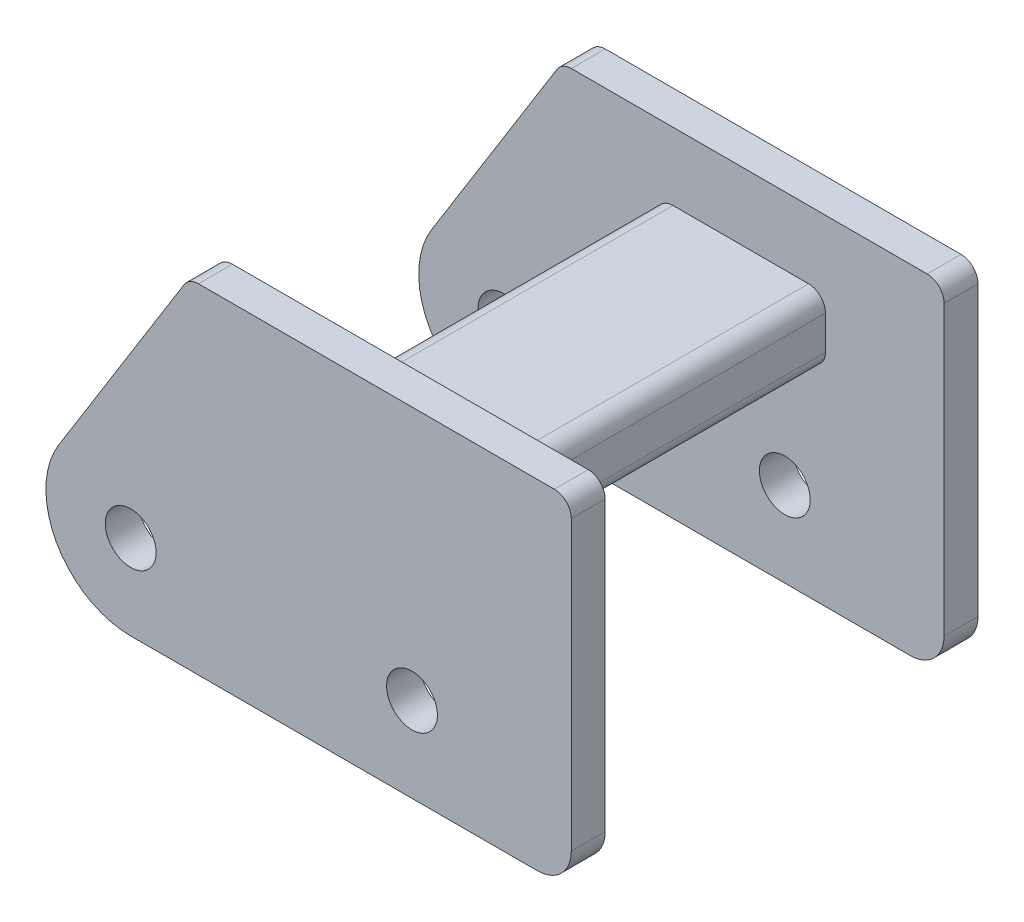
ISO-10303-21;
HEADER;
FILE_DESCRIPTION(('STEP AP214'),'2;1');
FILE_NAME('part.step','',(''),(''),'','','');
FILE_SCHEMA(('AUTOMOTIVE_DESIGN { 1 0 10303 214 1 1 1 1 }'));
ENDSEC;
DATA;
#1=APPLICATION_CONTEXT('core data for automotive mechanical design processes');
#2=APPLICATION_PROTOCOL_DEFINITION('international standard','automotive_design',2000,#1);
#3=PRODUCT_CONTEXT('',#1,'mechanical');
#4=PRODUCT('Part','Part','',(#3));
#5=PRODUCT_RELATED_PRODUCT_CATEGORY('part','',(#4));
#6=PRODUCT_DEFINITION_FORMATION('','',#4);
#7=PRODUCT_DEFINITION_CONTEXT('part definition',#1,'design');
#8=PRODUCT_DEFINITION('design','',#6,#7);
#9=PRODUCT_DEFINITION_SHAPE('','',#8);
#10=(LENGTH_UNIT() NAMED_UNIT(*) SI_UNIT(.MILLI.,.METRE.));
#11=(NAMED_UNIT(*) PLANE_ANGLE_UNIT() SI_UNIT($,.RADIAN.));
#12=(NAMED_UNIT(*) SI_UNIT($,.STERADIAN.) SOLID_ANGLE_UNIT());
#13=UNCERTAINTY_MEASURE_WITH_UNIT(LENGTH_MEASURE(1.E-05),#10,'distance_accuracy_value','');
#14=(GEOMETRIC_REPRESENTATION_CONTEXT(3) GLOBAL_UNCERTAINTY_ASSIGNED_CONTEXT((#13)) GLOBAL_UNIT_ASSIGNED_CONTEXT((#10,
#11,#12)) REPRESENTATION_CONTEXT('',''));
#15=CARTESIAN_POINT('',(0.,0.,0.));
#16=DIRECTION('',(0.,0.,1.));
#17=DIRECTION('',(1.,0.,0.));
#18=AXIS2_PLACEMENT_3D('',#15,#16,#17);
#19=CARTESIAN_POINT('',(12.5,7.,1.));
#20=DIRECTION('',(0.,0.,-1.));
#21=DIRECTION('',(-1.,0.,0.));
#22=AXIS2_PLACEMENT_3D('',#19,#20,#21);
#23=CYLINDRICAL_SURFACE('',#22,0.5);
#24=CARTESIAN_POINT('',(12.5,7.,0.));
#25=DIRECTION('',(0.,0.,1.));
#26=DIRECTION('',(1.,0.,0.));
#27=AXIS2_PLACEMENT_3D('',#24,#25,#26);
#28=CIRCLE('',#27,0.5);
#29=CARTESIAN_POINT('',(13.,7.,0.));
#30=VERTEX_POINT('',#29);
#31=CARTESIAN_POINT('',(12.5,7.5,0.));
#32=VERTEX_POINT('',#31);
#33=EDGE_CURVE('E258',#30,#32,#28,.T.);
#34=ORIENTED_EDGE('',*,*,#33,.T.);
#35=DIRECTION('',(0.,0.,-1.));
#36=VECTOR('',#35,1.);
#37=CARTESIAN_POINT('',(12.5,7.5,1.));
#38=LINE('',#37,#36);
#39=CARTESIAN_POINT('',(12.5,7.5,1.));
#40=VERTEX_POINT('',#39);
#41=EDGE_CURVE('E146',#40,#32,#38,.T.);
#42=ORIENTED_EDGE('',*,*,#41,.F.);
#43=CARTESIAN_POINT('',(12.5,7.,1.));
#44=DIRECTION('',(0.,0.,1.));
#45=DIRECTION('',(1.,0.,0.));
#46=AXIS2_PLACEMENT_3D('',#43,#44,#45);
#47=CIRCLE('',#46,0.5);
#48=CARTESIAN_POINT('',(13.,7.,1.));
#49=VERTEX_POINT('',#48);
#50=EDGE_CURVE('E203',#49,#40,#47,.T.);
#51=ORIENTED_EDGE('',*,*,#50,.F.);
#52=DIRECTION('',(0.,0.,-1.));
#53=VECTOR('',#52,1.);
#54=CARTESIAN_POINT('',(13.,7.,1.));
#55=LINE('',#54,#53);
#56=EDGE_CURVE('E12',#49,#30,#55,.T.);
#57=ORIENTED_EDGE('',*,*,#56,.T.);
#58=EDGE_LOOP('',(#34,#42,#51,#57));
#59=FACE_BOUND('',#58,.T.);
#60=ADVANCED_FACE('F138',(#59),#23,.T.);
#61=CARTESIAN_POINT('',(0.,7.5,1.));
#62=DIRECTION('',(0.,-1.,0.));
#63=DIRECTION('',(0.,0.,-1.));
#64=AXIS2_PLACEMENT_3D('',#61,#62,#63);
#65=PLANE('',#64);
#66=DIRECTION('',(-1.,0.,0.));
#67=VECTOR('',#66,1.);
#68=CARTESIAN_POINT('',(0.,7.5,0.));
#69=LINE('',#68,#67);
#70=CARTESIAN_POINT('',(2.,7.5,0.));
#71=VERTEX_POINT('',#70);
#72=EDGE_CURVE('E260',#32,#71,#69,.T.);
#73=ORIENTED_EDGE('',*,*,#72,.T.);
#74=DIRECTION('',(0.,0.,-1.));
#75=VECTOR('',#74,1.);
#76=CARTESIAN_POINT('',(2.,7.5,1.));
#77=LINE('',#76,#75);
#78=CARTESIAN_POINT('',(2.,7.5,1.));
#79=VERTEX_POINT('',#78);
#80=EDGE_CURVE('E278',#79,#71,#77,.T.);
#81=ORIENTED_EDGE('',*,*,#80,.F.);
#82=DIRECTION('',(-1.,0.,0.));
#83=VECTOR('',#82,1.);
#84=CARTESIAN_POINT('',(0.,7.5,1.));
#85=LINE('',#84,#83);
#86=EDGE_CURVE('E285',#40,#79,#85,.T.);
#87=ORIENTED_EDGE('',*,*,#86,.F.);
#88=ORIENTED_EDGE('',*,*,#41,.T.);
#89=EDGE_LOOP('',(#73,#81,#87,#88));
#90=FACE_BOUND('',#89,.T.);
#91=ADVANCED_FACE('F283',(#90),#65,.F.);
#92=CARTESIAN_POINT('',(2.,7.,1.));
#93=DIRECTION('',(0.,0.,-1.));
#94=DIRECTION('',(-1.,0.,0.));
#95=AXIS2_PLACEMENT_3D('',#92,#93,#94);
#96=CYLINDRICAL_SURFACE('',#95,0.500000000000001);
#97=CARTESIAN_POINT('',(2.,7.,0.));
#98=DIRECTION('',(0.,0.,1.));
#99=DIRECTION('',(1.,0.,0.));
#100=AXIS2_PLACEMENT_3D('',#97,#98,#99);
#101=CIRCLE('',#100,0.500000000000001);
#102=CARTESIAN_POINT('',(1.57547169811321,7.26415094339623,0.));
#103=VERTEX_POINT('',#102);
#104=EDGE_CURVE('E263',#103,#71,#101,.F.);
#105=ORIENTED_EDGE('',*,*,#104,.F.);
#106=DIRECTION('',(0.,0.,-1.));
#107=VECTOR('',#106,1.);
#108=CARTESIAN_POINT('',(1.57547169811321,7.26415094339623,1.));
#109=LINE('',#108,#107);
#110=CARTESIAN_POINT('',(1.57547169811321,7.26415094339623,1.));
#111=VERTEX_POINT('',#110);
#112=EDGE_CURVE('E276',#111,#103,#109,.T.);
#113=ORIENTED_EDGE('',*,*,#112,.F.);
#114=CARTESIAN_POINT('',(2.,7.,1.));
#115=DIRECTION('',(0.,0.,1.));
#116=DIRECTION('',(1.,0.,0.));
#117=AXIS2_PLACEMENT_3D('',#114,#115,#116);
#118=CIRCLE('',#117,0.500000000000001);
#119=EDGE_CURVE('E294',#111,#79,#118,.F.);
#120=ORIENTED_EDGE('',*,*,#119,.T.);
#121=ORIENTED_EDGE('',*,*,#80,.T.);
#122=EDGE_LOOP('',(#105,#113,#120,#121));
#123=FACE_BOUND('',#122,.T.);
#124=ADVANCED_FACE('F292',(#123),#96,.T.);
#125=CARTESIAN_POINT('',(-2.12264150943396,1.32075471698113,1.));
#126=DIRECTION('',(0.849056603773585,-0.528301886792453,0.));
#127=DIRECTION('',(0.528301886792453,0.849056603773584,0.));
#128=AXIS2_PLACEMENT_3D('',#125,#126,#127);
#129=PLANE('',#128);
#130=DIRECTION('',(-0.528301886792453,-0.849056603773585,0.));
#131=VECTOR('',#130,1.);
#132=CARTESIAN_POINT('',(-2.12264150943396,1.32075471698113,0.));
#133=LINE('',#132,#131);
#134=CARTESIAN_POINT('',(-2.12264150943396,1.32075471698113,0.));
#135=VERTEX_POINT('',#134);
#136=EDGE_CURVE('E266',#103,#135,#133,.T.);
#137=ORIENTED_EDGE('',*,*,#136,.T.);
#138=DIRECTION('',(0.,0.,-1.));
#139=VECTOR('',#138,1.);
#140=CARTESIAN_POINT('',(-2.12264150943396,1.32075471698113,1.));
#141=LINE('',#140,#139);
#142=CARTESIAN_POINT('',(-2.12264150943396,1.32075471698113,1.));
#143=VERTEX_POINT('',#142);
#144=EDGE_CURVE('E239',#143,#135,#141,.T.);
#145=ORIENTED_EDGE('',*,*,#144,.F.);
#146=DIRECTION('',(-0.528301886792453,-0.849056603773585,0.));
#147=VECTOR('',#146,1.);
#148=CARTESIAN_POINT('',(-2.12264150943396,1.32075471698113,1.));
#149=LINE('',#148,#147);
#150=EDGE_CURVE('E227',#111,#143,#149,.T.);
#151=ORIENTED_EDGE('',*,*,#150,.F.);
#152=ORIENTED_EDGE('',*,*,#112,.T.);
#153=EDGE_LOOP('',(#137,#145,#151,#152));
#154=FACE_BOUND('',#153,.T.);
#155=ADVANCED_FACE('F519',(#154),#129,.F.);
#156=CARTESIAN_POINT('',(0.,0.,1.));
#157=DIRECTION('',(0.,0.,-1.));
#158=DIRECTION('',(-1.,0.,0.));
#159=AXIS2_PLACEMENT_3D('',#156,#157,#158);
#160=CYLINDRICAL_SURFACE('',#159,2.5);
#161=CARTESIAN_POINT('',(0.,0.,0.));
#162=DIRECTION('',(0.,0.,1.));
#163=DIRECTION('',(1.,0.,0.));
#164=AXIS2_PLACEMENT_3D('',#161,#162,#163);
#165=CIRCLE('',#164,2.5);
#166=CARTESIAN_POINT('',(0.,-2.5,0.));
#167=VERTEX_POINT('',#166);
#168=EDGE_CURVE('E236',#135,#167,#165,.T.);
#169=ORIENTED_EDGE('',*,*,#168,.T.);
#170=DIRECTION('',(0.,0.,-1.));
#171=VECTOR('',#170,1.);
#172=CARTESIAN_POINT('',(0.,-2.5,1.));
#173=LINE('',#172,#171);
#174=CARTESIAN_POINT('',(0.,-2.5,1.));
#175=VERTEX_POINT('',#174);
#176=EDGE_CURVE('E233',#175,#167,#173,.T.);
#177=ORIENTED_EDGE('',*,*,#176,.F.);
#178=CARTESIAN_POINT('',(0.,0.,1.));
#179=DIRECTION('',(0.,0.,1.));
#180=DIRECTION('',(1.,0.,0.));
#181=AXIS2_PLACEMENT_3D('',#178,#179,#180);
#182=CIRCLE('',#181,2.5);
#183=EDGE_CURVE('E219',#143,#175,#182,.T.);
#184=ORIENTED_EDGE('',*,*,#183,.F.);
#185=ORIENTED_EDGE('',*,*,#144,.T.);
#186=EDGE_LOOP('',(#169,#177,#184,#185));
#187=FACE_BOUND('',#186,.T.);
#188=ADVANCED_FACE('F234',(#187),#160,.T.);
#189=CARTESIAN_POINT('',(0.,-2.5,1.));
#190=DIRECTION('',(0.,1.,0.));
#191=DIRECTION('',(0.,0.,1.));
#192=AXIS2_PLACEMENT_3D('',#189,#190,#191);
#193=PLANE('',#192);
#194=DIRECTION('',(1.,0.,0.));
#195=VECTOR('',#194,1.);
#196=CARTESIAN_POINT('',(0.,-2.5,0.));
#197=LINE('',#196,#195);
#198=CARTESIAN_POINT('',(12.,-2.5,0.));
#199=VERTEX_POINT('',#198);
#200=EDGE_CURVE('E269',#167,#199,#197,.T.);
#201=ORIENTED_EDGE('',*,*,#200,.T.);
#202=DIRECTION('',(0.,0.,-1.));
#203=VECTOR('',#202,1.);
#204=CARTESIAN_POINT('',(12.,-2.5,1.));
#205=LINE('',#204,#203);
#206=CARTESIAN_POINT('',(12.,-2.5,1.));
#207=VERTEX_POINT('',#206);
#208=EDGE_CURVE('E240',#207,#199,#205,.T.);
#209=ORIENTED_EDGE('',*,*,#208,.F.);
#210=DIRECTION('',(1.,0.,0.));
#211=VECTOR('',#210,1.);
#212=CARTESIAN_POINT('',(0.,-2.5,1.));
#213=LINE('',#212,#211);
#214=EDGE_CURVE('E223',#175,#207,#213,.T.);
#215=ORIENTED_EDGE('',*,*,#214,.F.);
#216=ORIENTED_EDGE('',*,*,#176,.T.);
#217=EDGE_LOOP('',(#201,#209,#215,#216));
#218=FACE_BOUND('',#217,.T.);
#219=ADVANCED_FACE('F242',(#218),#193,.F.);
#220=CARTESIAN_POINT('',(12.,-1.5,1.));
#221=DIRECTION('',(0.,0.,-1.));
#222=DIRECTION('',(-1.,0.,0.));
#223=AXIS2_PLACEMENT_3D('',#220,#221,#222);
#224=CYLINDRICAL_SURFACE('',#223,1.);
#225=CARTESIAN_POINT('',(12.,-1.5,0.));
#226=DIRECTION('',(0.,0.,1.));
#227=DIRECTION('',(1.,0.,0.));
#228=AXIS2_PLACEMENT_3D('',#225,#226,#227);
#229=CIRCLE('',#228,1.);
#230=CARTESIAN_POINT('',(13.,-1.5,0.));
#231=VERTEX_POINT('',#230);
#232=EDGE_CURVE('E195',#199,#231,#229,.T.);
#233=ORIENTED_EDGE('',*,*,#232,.T.);
#234=DIRECTION('',(0.,0.,-1.));
#235=VECTOR('',#234,1.);
#236=CARTESIAN_POINT('',(13.,-1.5,1.));
#237=LINE('',#236,#235);
#238=CARTESIAN_POINT('',(13.,-1.5,1.));
#239=VERTEX_POINT('',#238);
#240=EDGE_CURVE('E244',#239,#231,#237,.T.);
#241=ORIENTED_EDGE('',*,*,#240,.F.);
#242=CARTESIAN_POINT('',(12.,-1.5,1.));
#243=DIRECTION('',(0.,0.,1.));
#244=DIRECTION('',(1.,0.,0.));
#245=AXIS2_PLACEMENT_3D('',#242,#243,#244);
#246=CIRCLE('',#245,1.);
#247=EDGE_CURVE('E162',#207,#239,#246,.T.);
#248=ORIENTED_EDGE('',*,*,#247,.F.);
#249=ORIENTED_EDGE('',*,*,#208,.T.);
#250=EDGE_LOOP('',(#233,#241,#248,#249));
#251=FACE_BOUND('',#250,.T.);
#252=ADVANCED_FACE('F490',(#251),#224,.T.);
#253=CARTESIAN_POINT('',(13.,0.,1.));
#254=DIRECTION('',(-1.,0.,0.));
#255=DIRECTION('',(0.,-1.,0.));
#256=AXIS2_PLACEMENT_3D('',#253,#254,#255);
#257=PLANE('',#256);
#258=DIRECTION('',(0.,1.,0.));
#259=VECTOR('',#258,1.);
#260=CARTESIAN_POINT('',(13.,0.,0.));
#261=LINE('',#260,#259);
#262=EDGE_CURVE('E255',#231,#30,#261,.T.);
#263=ORIENTED_EDGE('',*,*,#262,.T.);
#264=ORIENTED_EDGE('',*,*,#56,.F.);
#265=DIRECTION('',(0.,1.,0.));
#266=VECTOR('',#265,1.);
#267=CARTESIAN_POINT('',(13.,0.,1.));
#268=LINE('',#267,#266);
#269=EDGE_CURVE('E299',#239,#49,#268,.T.);
#270=ORIENTED_EDGE('',*,*,#269,.F.);
#271=ORIENTED_EDGE('',*,*,#240,.T.);
#272=EDGE_LOOP('',(#263,#264,#270,#271));
#273=FACE_BOUND('',#272,.T.);
#274=ADVANCED_FACE('F487',(#273),#257,.F.);
#275=CARTESIAN_POINT('',(0.,0.,1.));
#276=DIRECTION('',(0.,0.,-1.));
#277=DIRECTION('',(-1.,0.,0.));
#278=AXIS2_PLACEMENT_3D('',#275,#276,#277);
#279=CYLINDRICAL_SURFACE('',#278,0.75);
#280=CARTESIAN_POINT('',(0.,0.,1.));
#281=DIRECTION('',(0.,0.,1.));
#282=DIRECTION('',(1.,0.,0.));
#283=AXIS2_PLACEMENT_3D('',#280,#281,#282);
#284=CIRCLE('',#283,0.75);
#285=CARTESIAN_POINT('',(0.75,0.,1.));
#286=VERTEX_POINT('',#285);
#287=EDGE_CURVE('E301',#286,#286,#284,.T.);
#288=ORIENTED_EDGE('',*,*,#287,.T.);
#289=EDGE_LOOP('',(#288));
#290=FACE_BOUND('',#289,.T.);
#291=CARTESIAN_POINT('',(0.,0.,0.));
#292=DIRECTION('',(0.,0.,1.));
#293=DIRECTION('',(1.,0.,0.));
#294=AXIS2_PLACEMENT_3D('',#291,#292,#293);
#295=CIRCLE('',#294,0.75);
#296=CARTESIAN_POINT('',(0.75,0.,0.));
#297=VERTEX_POINT('',#296);
#298=EDGE_CURVE('E251',#297,#297,#295,.T.);
#299=ORIENTED_EDGE('',*,*,#298,.F.);
#300=EDGE_LOOP('',(#299));
#301=FACE_BOUND('',#300,.T.);
#302=ADVANCED_FACE('F489',(#290,#301),#279,.F.);
#303=CARTESIAN_POINT('',(8.3,0.,1.));
#304=DIRECTION('',(0.,0.,-1.));
#305=DIRECTION('',(-1.,0.,0.));
#306=AXIS2_PLACEMENT_3D('',#303,#304,#305);
#307=CYLINDRICAL_SURFACE('',#306,0.75);
#308=CARTESIAN_POINT('',(8.3,0.,1.));
#309=DIRECTION('',(0.,0.,1.));
#310=DIRECTION('',(1.,0.,0.));
#311=AXIS2_PLACEMENT_3D('',#308,#309,#310);
#312=CIRCLE('',#311,0.75);
#313=CARTESIAN_POINT('',(9.05,0.,1.));
#314=VERTEX_POINT('',#313);
#315=EDGE_CURVE('E272',#314,#314,#312,.T.);
#316=ORIENTED_EDGE('',*,*,#315,.T.);
#317=EDGE_LOOP('',(#316));
#318=FACE_BOUND('',#317,.T.);
#319=CARTESIAN_POINT('',(8.3,0.,0.));
#320=DIRECTION('',(0.,0.,1.));
#321=DIRECTION('',(1.,0.,0.));
#322=AXIS2_PLACEMENT_3D('',#319,#320,#321);
#323=CIRCLE('',#322,0.75);
#324=CARTESIAN_POINT('',(9.05,0.,0.));
#325=VERTEX_POINT('',#324);
#326=EDGE_CURVE('E248',#325,#325,#323,.T.);
#327=ORIENTED_EDGE('',*,*,#326,.F.);
#328=EDGE_LOOP('',(#327));
#329=FACE_BOUND('',#328,.T.);
#330=ADVANCED_FACE('F140',(#318,#329),#307,.F.);
#331=CARTESIAN_POINT('',(0.,0.,0.));
#332=DIRECTION('',(0.,0.,1.));
#333=DIRECTION('',(1.,0.,0.));
#334=AXIS2_PLACEMENT_3D('',#331,#332,#333);
#335=PLANE('',#334);
#336=ORIENTED_EDGE('',*,*,#326,.T.);
#337=EDGE_LOOP('',(#336));
#338=FACE_BOUND('',#337,.T.);
#339=ORIENTED_EDGE('',*,*,#298,.T.);
#340=EDGE_LOOP('',(#339));
#341=FACE_BOUND('',#340,.T.);
#342=ORIENTED_EDGE('',*,*,#262,.F.);
#343=ORIENTED_EDGE('',*,*,#232,.F.);
#344=ORIENTED_EDGE('',*,*,#200,.F.);
#345=ORIENTED_EDGE('',*,*,#168,.F.);
#346=ORIENTED_EDGE('',*,*,#136,.F.);
#347=ORIENTED_EDGE('',*,*,#104,.T.);
#348=ORIENTED_EDGE('',*,*,#72,.F.);
#349=ORIENTED_EDGE('',*,*,#33,.F.);
#350=EDGE_LOOP('',(#342,#343,#344,#345,#346,#347,#348,#349));
#351=FACE_BOUND('',#350,.T.);
#352=ADVANCED_FACE('F288',(#338,#341,#351),#335,.F.);
#353=CARTESIAN_POINT('',(0.,0.,1.));
#354=DIRECTION('',(0.,0.,1.));
#355=DIRECTION('',(1.,0.,0.));
#356=AXIS2_PLACEMENT_3D('',#353,#354,#355);
#357=PLANE('',#356);
#358=CARTESIAN_POINT('',(5.,5.,1.));
#359=DIRECTION('',(0.,0.,1.));
#360=DIRECTION('',(1.,0.,0.));
#361=AXIS2_PLACEMENT_3D('',#358,#359,#360);
#362=CIRCLE('',#361,0.5);
#363=CARTESIAN_POINT('',(5.,5.5,1.));
#364=VERTEX_POINT('',#363);
#365=CARTESIAN_POINT('',(4.5,5.,1.));
#366=VERTEX_POINT('',#365);
#367=EDGE_CURVE('E345',#364,#366,#362,.T.);
#368=ORIENTED_EDGE('',*,*,#367,.F.);
#369=DIRECTION('',(-1.,0.,0.));
#370=VECTOR('',#369,1.);
#371=CARTESIAN_POINT('',(0.,5.5,1.));
#372=LINE('',#371,#370);
#373=CARTESIAN_POINT('',(9.,5.5,1.));
#374=VERTEX_POINT('',#373);
#375=EDGE_CURVE('E348',#374,#364,#372,.T.);
#376=ORIENTED_EDGE('',*,*,#375,.F.);
#377=CARTESIAN_POINT('',(9.,5.,1.));
#378=DIRECTION('',(0.,0.,1.));
#379=DIRECTION('',(1.,0.,0.));
#380=AXIS2_PLACEMENT_3D('',#377,#378,#379);
#381=CIRCLE('',#380,0.500000000000001);
#382=CARTESIAN_POINT('',(9.5,5.,1.));
#383=VERTEX_POINT('',#382);
#384=EDGE_CURVE('E328',#383,#374,#381,.T.);
#385=ORIENTED_EDGE('',*,*,#384,.F.);
#386=DIRECTION('',(0.,1.,0.));
#387=VECTOR('',#386,1.);
#388=CARTESIAN_POINT('',(9.49999999999999,0.,1.));
#389=LINE('',#388,#387);
#390=CARTESIAN_POINT('',(9.5,4.,1.));
#391=VERTEX_POINT('',#390);
#392=EDGE_CURVE('E331',#391,#383,#389,.T.);
#393=ORIENTED_EDGE('',*,*,#392,.F.);
#394=CARTESIAN_POINT('',(9.,4.,1.));
#395=DIRECTION('',(0.,0.,1.));
#396=DIRECTION('',(1.,0.,0.));
#397=AXIS2_PLACEMENT_3D('',#394,#395,#396);
#398=CIRCLE('',#397,0.5);
#399=CARTESIAN_POINT('',(9.,3.5,1.));
#400=VERTEX_POINT('',#399);
#401=EDGE_CURVE('E333',#400,#391,#398,.T.);
#402=ORIENTED_EDGE('',*,*,#401,.F.);
#403=DIRECTION('',(-1.,0.,0.));
#404=VECTOR('',#403,1.);
#405=CARTESIAN_POINT('',(0.,3.5,1.));
#406=LINE('',#405,#404);
#407=CARTESIAN_POINT('',(5.,3.5,1.));
#408=VERTEX_POINT('',#407);
#409=EDGE_CURVE('E336',#400,#408,#406,.T.);
#410=ORIENTED_EDGE('',*,*,#409,.T.);
#411=CARTESIAN_POINT('',(5.,4.,1.));
#412=DIRECTION('',(0.,0.,1.));
#413=DIRECTION('',(1.,0.,0.));
#414=AXIS2_PLACEMENT_3D('',#411,#412,#413);
#415=CIRCLE('',#414,0.499999999999999);
#416=CARTESIAN_POINT('',(4.5,4.,1.));
#417=VERTEX_POINT('',#416);
#418=EDGE_CURVE('E339',#417,#408,#415,.T.);
#419=ORIENTED_EDGE('',*,*,#418,.F.);
#420=DIRECTION('',(0.,1.,0.));
#421=VECTOR('',#420,1.);
#422=CARTESIAN_POINT('',(4.50000000000001,0.,1.));
#423=LINE('',#422,#421);
#424=EDGE_CURVE('E342',#417,#366,#423,.T.);
#425=ORIENTED_EDGE('',*,*,#424,.T.);
#426=EDGE_LOOP('',(#368,#376,#385,#393,#402,#410,#419,#425));
#427=FACE_BOUND('',#426,.T.);
#428=ORIENTED_EDGE('',*,*,#315,.F.);
#429=EDGE_LOOP('',(#428));
#430=FACE_BOUND('',#429,.T.);
#431=ORIENTED_EDGE('',*,*,#287,.F.);
#432=EDGE_LOOP('',(#431));
#433=FACE_BOUND('',#432,.T.);
#434=ORIENTED_EDGE('',*,*,#269,.T.);
#435=ORIENTED_EDGE('',*,*,#50,.T.);
#436=ORIENTED_EDGE('',*,*,#86,.T.);
#437=ORIENTED_EDGE('',*,*,#119,.F.);
#438=ORIENTED_EDGE('',*,*,#150,.T.);
#439=ORIENTED_EDGE('',*,*,#183,.T.);
#440=ORIENTED_EDGE('',*,*,#214,.T.);
#441=ORIENTED_EDGE('',*,*,#247,.T.);
#442=EDGE_LOOP('',(#434,#435,#436,#437,#438,#439,#440,#441));
#443=FACE_BOUND('',#442,.T.);
#444=ADVANCED_FACE('F221',(#427,#430,#433,#443),#357,.T.);
#445=CARTESIAN_POINT('',(0.,5.5,11.));
#446=DIRECTION('',(0.,-1.,0.));
#447=DIRECTION('',(0.,0.,-1.));
#448=AXIS2_PLACEMENT_3D('',#445,#446,#447);
#449=PLANE('',#448);
#450=ORIENTED_EDGE('',*,*,#375,.T.);
#451=DIRECTION('',(0.,0.,-1.));
#452=VECTOR('',#451,1.);
#453=CARTESIAN_POINT('',(5.,5.5,11.));
#454=LINE('',#453,#452);
#455=CARTESIAN_POINT('',(5.,5.5,11.));
#456=VERTEX_POINT('',#455);
#457=EDGE_CURVE('E252',#456,#364,#454,.T.);
#458=ORIENTED_EDGE('',*,*,#457,.F.);
#459=DIRECTION('',(-1.,0.,0.));
#460=VECTOR('',#459,1.);
#461=CARTESIAN_POINT('',(0.,5.5,11.));
#462=LINE('',#461,#460);
#463=CARTESIAN_POINT('',(9.,5.5,11.));
#464=VERTEX_POINT('',#463);
#465=EDGE_CURVE('E330',#464,#456,#462,.T.);
#466=ORIENTED_EDGE('',*,*,#465,.F.);
#467=DIRECTION('',(0.,0.,-1.));
#468=VECTOR('',#467,1.);
#469=CARTESIAN_POINT('',(9.,5.5,11.));
#470=LINE('',#469,#468);
#471=EDGE_CURVE('E324',#464,#374,#470,.T.);
#472=ORIENTED_EDGE('',*,*,#471,.T.);
#473=EDGE_LOOP('',(#450,#458,#466,#472));
#474=FACE_BOUND('',#473,.T.);
#475=ADVANCED_FACE('F508',(#474),#449,.F.);
#476=CARTESIAN_POINT('',(5.,5.,11.));
#477=DIRECTION('',(0.,0.,-1.));
#478=DIRECTION('',(-1.,0.,0.));
#479=AXIS2_PLACEMENT_3D('',#476,#477,#478);
#480=CYLINDRICAL_SURFACE('',#479,0.5);
#481=ORIENTED_EDGE('',*,*,#367,.T.);
#482=DIRECTION('',(0.,0.,-1.));
#483=VECTOR('',#482,1.);
#484=CARTESIAN_POINT('',(4.5,5.,11.));
#485=LINE('',#484,#483);
#486=CARTESIAN_POINT('',(4.5,5.,11.));
#487=VERTEX_POINT('',#486);
#488=EDGE_CURVE('E308',#487,#366,#485,.T.);
#489=ORIENTED_EDGE('',*,*,#488,.F.);
#490=CARTESIAN_POINT('',(5.,5.,11.));
#491=DIRECTION('',(0.,0.,1.));
#492=DIRECTION('',(1.,0.,0.));
#493=AXIS2_PLACEMENT_3D('',#490,#491,#492);
#494=CIRCLE('',#493,0.5);
#495=EDGE_CURVE('E369',#456,#487,#494,.T.);
#496=ORIENTED_EDGE('',*,*,#495,.F.);
#497=ORIENTED_EDGE('',*,*,#457,.T.);
#498=EDGE_LOOP('',(#481,#489,#496,#497));
#499=FACE_BOUND('',#498,.T.);
#500=ADVANCED_FACE('F576',(#499),#480,.T.);
#501=CARTESIAN_POINT('',(4.50000000000001,0.,11.));
#502=DIRECTION('',(-1.,0.,0.));
#503=DIRECTION('',(0.,-1.,0.));
#504=AXIS2_PLACEMENT_3D('',#501,#502,#503);
#505=PLANE('',#504);
#506=ORIENTED_EDGE('',*,*,#424,.F.);
#507=DIRECTION('',(0.,0.,-1.));
#508=VECTOR('',#507,1.);
#509=CARTESIAN_POINT('',(4.5,4.,11.));
#510=LINE('',#509,#508);
#511=CARTESIAN_POINT('',(4.5,4.,11.));
#512=VERTEX_POINT('',#511);
#513=EDGE_CURVE('E311',#512,#417,#510,.T.);
#514=ORIENTED_EDGE('',*,*,#513,.F.);
#515=DIRECTION('',(0.,1.,0.));
#516=VECTOR('',#515,1.);
#517=CARTESIAN_POINT('',(4.50000000000001,0.,11.));
#518=LINE('',#517,#516);
#519=EDGE_CURVE('E366',#512,#487,#518,.T.);
#520=ORIENTED_EDGE('',*,*,#519,.T.);
#521=ORIENTED_EDGE('',*,*,#488,.T.);
#522=EDGE_LOOP('',(#506,#514,#520,#521));
#523=FACE_BOUND('',#522,.T.);
#524=ADVANCED_FACE('F585',(#523),#505,.T.);
#525=CARTESIAN_POINT('',(5.,4.,11.));
#526=DIRECTION('',(0.,0.,-1.));
#527=DIRECTION('',(-1.,0.,0.));
#528=AXIS2_PLACEMENT_3D('',#525,#526,#527);
#529=CYLINDRICAL_SURFACE('',#528,0.499999999999999);
#530=ORIENTED_EDGE('',*,*,#418,.T.);
#531=DIRECTION('',(0.,0.,-1.));
#532=VECTOR('',#531,1.);
#533=CARTESIAN_POINT('',(5.,3.5,11.));
#534=LINE('',#533,#532);
#535=CARTESIAN_POINT('',(5.,3.5,11.));
#536=VERTEX_POINT('',#535);
#537=EDGE_CURVE('E314',#536,#408,#534,.T.);
#538=ORIENTED_EDGE('',*,*,#537,.F.);
#539=CARTESIAN_POINT('',(5.,4.,11.));
#540=DIRECTION('',(0.,0.,1.));
#541=DIRECTION('',(1.,0.,0.));
#542=AXIS2_PLACEMENT_3D('',#539,#540,#541);
#543=CIRCLE('',#542,0.499999999999999);
#544=EDGE_CURVE('E363',#512,#536,#543,.T.);
#545=ORIENTED_EDGE('',*,*,#544,.F.);
#546=ORIENTED_EDGE('',*,*,#513,.T.);
#547=EDGE_LOOP('',(#530,#538,#545,#546));
#548=FACE_BOUND('',#547,.T.);
#549=ADVANCED_FACE('F595',(#548),#529,.T.);
#550=CARTESIAN_POINT('',(0.,3.5,11.));
#551=DIRECTION('',(0.,-1.,0.));
#552=DIRECTION('',(0.,0.,-1.));
#553=AXIS2_PLACEMENT_3D('',#550,#551,#552);
#554=PLANE('',#553);
#555=ORIENTED_EDGE('',*,*,#409,.F.);
#556=DIRECTION('',(0.,0.,-1.));
#557=VECTOR('',#556,1.);
#558=CARTESIAN_POINT('',(9.,3.5,11.));
#559=LINE('',#558,#557);
#560=CARTESIAN_POINT('',(9.,3.5,11.));
#561=VERTEX_POINT('',#560);
#562=EDGE_CURVE('E317',#561,#400,#559,.T.);
#563=ORIENTED_EDGE('',*,*,#562,.F.);
#564=DIRECTION('',(-1.,0.,0.));
#565=VECTOR('',#564,1.);
#566=CARTESIAN_POINT('',(0.,3.5,11.));
#567=LINE('',#566,#565);
#568=EDGE_CURVE('E360',#561,#536,#567,.T.);
#569=ORIENTED_EDGE('',*,*,#568,.T.);
#570=ORIENTED_EDGE('',*,*,#537,.T.);
#571=EDGE_LOOP('',(#555,#563,#569,#570));
#572=FACE_BOUND('',#571,.T.);
#573=ADVANCED_FACE('F605',(#572),#554,.T.);
#574=CARTESIAN_POINT('',(9.,4.,11.));
#575=DIRECTION('',(0.,0.,-1.));
#576=DIRECTION('',(-1.,0.,0.));
#577=AXIS2_PLACEMENT_3D('',#574,#575,#576);
#578=CYLINDRICAL_SURFACE('',#577,0.5);
#579=ORIENTED_EDGE('',*,*,#401,.T.);
#580=DIRECTION('',(0.,0.,-1.));
#581=VECTOR('',#580,1.);
#582=CARTESIAN_POINT('',(9.5,4.,11.));
#583=LINE('',#582,#581);
#584=CARTESIAN_POINT('',(9.5,4.,11.));
#585=VERTEX_POINT('',#584);
#586=EDGE_CURVE('E320',#585,#391,#583,.T.);
#587=ORIENTED_EDGE('',*,*,#586,.F.);
#588=CARTESIAN_POINT('',(9.,4.,11.));
#589=DIRECTION('',(0.,0.,1.));
#590=DIRECTION('',(1.,0.,0.));
#591=AXIS2_PLACEMENT_3D('',#588,#589,#590);
#592=CIRCLE('',#591,0.5);
#593=EDGE_CURVE('E357',#561,#585,#592,.T.);
#594=ORIENTED_EDGE('',*,*,#593,.F.);
#595=ORIENTED_EDGE('',*,*,#562,.T.);
#596=EDGE_LOOP('',(#579,#587,#594,#595));
#597=FACE_BOUND('',#596,.T.);
#598=ADVANCED_FACE('F615',(#597),#578,.T.);
#599=CARTESIAN_POINT('',(9.49999999999999,0.,11.));
#600=DIRECTION('',(-1.,0.,0.));
#601=DIRECTION('',(0.,-1.,0.));
#602=AXIS2_PLACEMENT_3D('',#599,#600,#601);
#603=PLANE('',#602);
#604=ORIENTED_EDGE('',*,*,#392,.T.);
#605=DIRECTION('',(0.,0.,-1.));
#606=VECTOR('',#605,1.);
#607=CARTESIAN_POINT('',(9.5,5.,11.));
#608=LINE('',#607,#606);
#609=CARTESIAN_POINT('',(9.5,5.,11.));
#610=VERTEX_POINT('',#609);
#611=EDGE_CURVE('E153',#610,#383,#608,.T.);
#612=ORIENTED_EDGE('',*,*,#611,.F.);
#613=DIRECTION('',(0.,1.,0.));
#614=VECTOR('',#613,1.);
#615=CARTESIAN_POINT('',(9.49999999999999,0.,11.));
#616=LINE('',#615,#614);
#617=EDGE_CURVE('E354',#585,#610,#616,.T.);
#618=ORIENTED_EDGE('',*,*,#617,.F.);
#619=ORIENTED_EDGE('',*,*,#586,.T.);
#620=EDGE_LOOP('',(#604,#612,#618,#619));
#621=FACE_BOUND('',#620,.T.);
#622=ADVANCED_FACE('F474',(#621),#603,.F.);
#623=CARTESIAN_POINT('',(9.,5.,11.));
#624=DIRECTION('',(0.,0.,-1.));
#625=DIRECTION('',(-1.,0.,0.));
#626=AXIS2_PLACEMENT_3D('',#623,#624,#625);
#627=CYLINDRICAL_SURFACE('',#626,0.500000000000001);
#628=ORIENTED_EDGE('',*,*,#384,.T.);
#629=ORIENTED_EDGE('',*,*,#471,.F.);
#630=CARTESIAN_POINT('',(9.,5.,11.));
#631=DIRECTION('',(0.,0.,1.));
#632=DIRECTION('',(1.,0.,0.));
#633=AXIS2_PLACEMENT_3D('',#630,#631,#632);
#634=CIRCLE('',#633,0.500000000000001);
#635=EDGE_CURVE('E327',#610,#464,#634,.T.);
#636=ORIENTED_EDGE('',*,*,#635,.F.);
#637=ORIENTED_EDGE('',*,*,#611,.T.);
#638=EDGE_LOOP('',(#628,#629,#636,#637));
#639=FACE_BOUND('',#638,.T.);
#640=ADVANCED_FACE('F464',(#639),#627,.T.);
#641=CARTESIAN_POINT('',(2.,7.,12.));
#642=DIRECTION('',(0.,0.,1.));
#643=DIRECTION('',(1.,0.,0.));
#644=AXIS2_PLACEMENT_3D('',#641,#642,#643);
#645=PLANE('',#644);
#646=CARTESIAN_POINT('',(0.,0.,12.));
#647=DIRECTION('',(0.,0.,1.));
#648=DIRECTION('',(1.,0.,0.));
#649=AXIS2_PLACEMENT_3D('',#646,#647,#648);
#650=CIRCLE('',#649,0.75);
#651=CARTESIAN_POINT('',(0.75,0.,12.));
#652=VERTEX_POINT('',#651);
#653=EDGE_CURVE('E423',#652,#652,#650,.T.);
#654=ORIENTED_EDGE('',*,*,#653,.F.);
#655=EDGE_LOOP('',(#654));
#656=FACE_BOUND('',#655,.T.);
#657=CARTESIAN_POINT('',(2.,7.,12.));
#658=DIRECTION('',(0.,0.,1.));
#659=DIRECTION('',(1.,0.,0.));
#660=AXIS2_PLACEMENT_3D('',#657,#658,#659);
#661=CIRCLE('',#660,0.500000000000001);
#662=CARTESIAN_POINT('',(2.,7.5,12.));
#663=VERTEX_POINT('',#662);
#664=CARTESIAN_POINT('',(1.57547169811321,7.26415094339623,12.));
#665=VERTEX_POINT('',#664);
#666=EDGE_CURVE('E401',#663,#665,#661,.T.);
#667=ORIENTED_EDGE('',*,*,#666,.T.);
#668=DIRECTION('',(0.528301886792453,0.849056603773585,0.));
#669=VECTOR('',#668,1.);
#670=CARTESIAN_POINT('',(1.51566393734425,7.16803132787469,12.));
#671=LINE('',#670,#669);
#672=CARTESIAN_POINT('',(-2.12264150943396,1.32075471698113,12.));
#673=VERTEX_POINT('',#672);
#674=EDGE_CURVE('E441',#673,#665,#671,.T.);
#675=ORIENTED_EDGE('',*,*,#674,.F.);
#676=CARTESIAN_POINT('',(0.,0.,12.));
#677=DIRECTION('',(0.,0.,1.));
#678=DIRECTION('',(1.,0.,0.));
#679=AXIS2_PLACEMENT_3D('',#676,#677,#678);
#680=CIRCLE('',#679,2.5);
#681=CARTESIAN_POINT('',(0.,-2.5,12.));
#682=VERTEX_POINT('',#681);
#683=EDGE_CURVE('E438',#673,#682,#680,.T.);
#684=ORIENTED_EDGE('',*,*,#683,.T.);
#685=DIRECTION('',(-1.,0.,0.));
#686=VECTOR('',#685,1.);
#687=CARTESIAN_POINT('',(5.,-2.5,12.));
#688=LINE('',#687,#686);
#689=CARTESIAN_POINT('',(12.,-2.5,12.));
#690=VERTEX_POINT('',#689);
#691=EDGE_CURVE('E435',#690,#682,#688,.T.);
#692=ORIENTED_EDGE('',*,*,#691,.F.);
#693=CARTESIAN_POINT('',(12.,-1.5,12.));
#694=DIRECTION('',(0.,0.,1.));
#695=DIRECTION('',(1.,0.,0.));
#696=AXIS2_PLACEMENT_3D('',#693,#694,#695);
#697=CIRCLE('',#696,1.);
#698=CARTESIAN_POINT('',(13.,-1.5,12.));
#699=VERTEX_POINT('',#698);
#700=EDGE_CURVE('E432',#690,#699,#697,.T.);
#701=ORIENTED_EDGE('',*,*,#700,.T.);
#702=DIRECTION('',(0.,-1.,0.));
#703=VECTOR('',#702,1.);
#704=CARTESIAN_POINT('',(13.,5.,12.));
#705=LINE('',#704,#703);
#706=CARTESIAN_POINT('',(13.,7.,12.));
#707=VERTEX_POINT('',#706);
#708=EDGE_CURVE('E429',#707,#699,#705,.T.);
#709=ORIENTED_EDGE('',*,*,#708,.F.);
#710=CARTESIAN_POINT('',(12.5,7.,12.));
#711=DIRECTION('',(0.,0.,1.));
#712=DIRECTION('',(1.,0.,0.));
#713=AXIS2_PLACEMENT_3D('',#710,#711,#712);
#714=CIRCLE('',#713,0.5);
#715=CARTESIAN_POINT('',(12.5,7.5,12.));
#716=VERTEX_POINT('',#715);
#717=EDGE_CURVE('E426',#707,#716,#714,.T.);
#718=ORIENTED_EDGE('',*,*,#717,.T.);
#719=DIRECTION('',(1.,0.,0.));
#720=VECTOR('',#719,1.);
#721=CARTESIAN_POINT('',(5.,7.5,12.));
#722=LINE('',#721,#720);
#723=EDGE_CURVE('E397',#663,#716,#722,.T.);
#724=ORIENTED_EDGE('',*,*,#723,.F.);
#725=EDGE_LOOP('',(#667,#675,#684,#692,#701,#709,#718,#724));
#726=FACE_BOUND('',#725,.T.);
#727=CARTESIAN_POINT('',(8.3,0.,12.));
#728=DIRECTION('',(0.,0.,1.));
#729=DIRECTION('',(1.,0.,0.));
#730=AXIS2_PLACEMENT_3D('',#727,#728,#729);
#731=CIRCLE('',#730,0.75);
#732=CARTESIAN_POINT('',(9.05,0.,12.));
#733=VERTEX_POINT('',#732);
#734=EDGE_CURVE('E449',#733,#733,#731,.T.);
#735=ORIENTED_EDGE('',*,*,#734,.F.);
#736=EDGE_LOOP('',(#735));
#737=FACE_BOUND('',#736,.T.);
#738=ADVANCED_FACE('F461',(#656,#726,#737),#645,.T.);
#739=CARTESIAN_POINT('',(2.,7.,11.));
#740=DIRECTION('',(0.,0.,1.));
#741=DIRECTION('',(1.,0.,0.));
#742=AXIS2_PLACEMENT_3D('',#739,#740,#741);
#743=PLANE('',#742);
#744=ORIENTED_EDGE('',*,*,#635,.T.);
#745=ORIENTED_EDGE('',*,*,#465,.T.);
#746=ORIENTED_EDGE('',*,*,#495,.T.);
#747=ORIENTED_EDGE('',*,*,#519,.F.);
#748=ORIENTED_EDGE('',*,*,#544,.T.);
#749=ORIENTED_EDGE('',*,*,#568,.F.);
#750=ORIENTED_EDGE('',*,*,#593,.T.);
#751=ORIENTED_EDGE('',*,*,#617,.T.);
#752=EDGE_LOOP('',(#744,#745,#746,#747,#748,#749,#750,#751));
#753=FACE_BOUND('',#752,.T.);
#754=CARTESIAN_POINT('',(2.,7.,11.));
#755=DIRECTION('',(0.,0.,1.));
#756=DIRECTION('',(1.,0.,0.));
#757=AXIS2_PLACEMENT_3D('',#754,#755,#756);
#758=CIRCLE('',#757,0.500000000000001);
#759=CARTESIAN_POINT('',(2.,7.5,11.));
#760=VERTEX_POINT('',#759);
#761=CARTESIAN_POINT('',(1.57547169811321,7.26415094339623,11.));
#762=VERTEX_POINT('',#761);
#763=EDGE_CURVE('E420',#760,#762,#758,.T.);
#764=ORIENTED_EDGE('',*,*,#763,.F.);
#765=DIRECTION('',(1.,0.,0.));
#766=VECTOR('',#765,1.);
#767=CARTESIAN_POINT('',(5.,7.5,11.));
#768=LINE('',#767,#766);
#769=CARTESIAN_POINT('',(12.5,7.5,11.));
#770=VERTEX_POINT('',#769);
#771=EDGE_CURVE('E398',#760,#770,#768,.T.);
#772=ORIENTED_EDGE('',*,*,#771,.T.);
#773=CARTESIAN_POINT('',(12.5,7.,11.));
#774=DIRECTION('',(0.,0.,1.));
#775=DIRECTION('',(1.,0.,0.));
#776=AXIS2_PLACEMENT_3D('',#773,#774,#775);
#777=CIRCLE('',#776,0.5);
#778=CARTESIAN_POINT('',(13.,7.,11.));
#779=VERTEX_POINT('',#778);
#780=EDGE_CURVE('E402',#779,#770,#777,.T.);
#781=ORIENTED_EDGE('',*,*,#780,.F.);
#782=DIRECTION('',(0.,-1.,0.));
#783=VECTOR('',#782,1.);
#784=CARTESIAN_POINT('',(13.,5.,11.));
#785=LINE('',#784,#783);
#786=CARTESIAN_POINT('',(13.,-1.5,11.));
#787=VERTEX_POINT('',#786);
#788=EDGE_CURVE('E405',#779,#787,#785,.T.);
#789=ORIENTED_EDGE('',*,*,#788,.T.);
#790=CARTESIAN_POINT('',(12.,-1.5,11.));
#791=DIRECTION('',(0.,0.,1.));
#792=DIRECTION('',(1.,0.,0.));
#793=AXIS2_PLACEMENT_3D('',#790,#791,#792);
#794=CIRCLE('',#793,1.);
#795=CARTESIAN_POINT('',(12.,-2.5,11.));
#796=VERTEX_POINT('',#795);
#797=EDGE_CURVE('E408',#796,#787,#794,.T.);
#798=ORIENTED_EDGE('',*,*,#797,.F.);
#799=DIRECTION('',(-1.,0.,0.));
#800=VECTOR('',#799,1.);
#801=CARTESIAN_POINT('',(5.,-2.5,11.));
#802=LINE('',#801,#800);
#803=CARTESIAN_POINT('',(0.,-2.5,11.));
#804=VERTEX_POINT('',#803);
#805=EDGE_CURVE('E411',#796,#804,#802,.T.);
#806=ORIENTED_EDGE('',*,*,#805,.T.);
#807=CARTESIAN_POINT('',(0.,0.,11.));
#808=DIRECTION('',(0.,0.,1.));
#809=DIRECTION('',(1.,0.,0.));
#810=AXIS2_PLACEMENT_3D('',#807,#808,#809);
#811=CIRCLE('',#810,2.5);
#812=CARTESIAN_POINT('',(-2.12264150943396,1.32075471698113,11.));
#813=VERTEX_POINT('',#812);
#814=EDGE_CURVE('E414',#813,#804,#811,.T.);
#815=ORIENTED_EDGE('',*,*,#814,.F.);
#816=DIRECTION('',(0.528301886792453,0.849056603773585,0.));
#817=VECTOR('',#816,1.);
#818=CARTESIAN_POINT('',(1.51566393734425,7.16803132787469,11.));
#819=LINE('',#818,#817);
#820=EDGE_CURVE('E417',#813,#762,#819,.T.);
#821=ORIENTED_EDGE('',*,*,#820,.T.);
#822=EDGE_LOOP('',(#764,#772,#781,#789,#798,#806,#815,#821));
#823=FACE_BOUND('',#822,.T.);
#824=CARTESIAN_POINT('',(0.,0.,11.));
#825=DIRECTION('',(0.,0.,1.));
#826=DIRECTION('',(1.,0.,0.));
#827=AXIS2_PLACEMENT_3D('',#824,#825,#826);
#828=CIRCLE('',#827,0.75);
#829=CARTESIAN_POINT('',(0.75,0.,11.));
#830=VERTEX_POINT('',#829);
#831=EDGE_CURVE('E446',#830,#830,#828,.T.);
#832=ORIENTED_EDGE('',*,*,#831,.T.);
#833=EDGE_LOOP('',(#832));
#834=FACE_BOUND('',#833,.T.);
#835=CARTESIAN_POINT('',(8.3,0.,11.));
#836=DIRECTION('',(0.,0.,1.));
#837=DIRECTION('',(1.,0.,0.));
#838=AXIS2_PLACEMENT_3D('',#835,#836,#837);
#839=CIRCLE('',#838,0.75);
#840=CARTESIAN_POINT('',(9.05,0.,11.));
#841=VERTEX_POINT('',#840);
#842=EDGE_CURVE('E452',#841,#841,#839,.T.);
#843=ORIENTED_EDGE('',*,*,#842,.T.);
#844=EDGE_LOOP('',(#843));
#845=FACE_BOUND('',#844,.T.);
#846=ADVANCED_FACE('F463',(#753,#823,#834,#845),#743,.F.);
#847=CARTESIAN_POINT('',(2.,7.,12.));
#848=DIRECTION('',(0.,0.,-1.));
#849=DIRECTION('',(-1.,0.,0.));
#850=AXIS2_PLACEMENT_3D('',#847,#848,#849);
#851=CYLINDRICAL_SURFACE('',#850,0.500000000000001);
#852=ORIENTED_EDGE('',*,*,#763,.T.);
#853=DIRECTION('',(0.,0.,-1.));
#854=VECTOR('',#853,1.);
#855=CARTESIAN_POINT('',(1.57547169811321,7.26415094339623,12.));
#856=LINE('',#855,#854);
#857=EDGE_CURVE('E351',#665,#762,#856,.T.);
#858=ORIENTED_EDGE('',*,*,#857,.F.);
#859=ORIENTED_EDGE('',*,*,#666,.F.);
#860=DIRECTION('',(0.,0.,-1.));
#861=VECTOR('',#860,1.);
#862=CARTESIAN_POINT('',(2.,7.5,12.));
#863=LINE('',#862,#861);
#864=EDGE_CURVE('E394',#663,#760,#863,.T.);
#865=ORIENTED_EDGE('',*,*,#864,.T.);
#866=EDGE_LOOP('',(#852,#858,#859,#865));
#867=FACE_BOUND('',#866,.T.);
#868=ADVANCED_FACE('F471',(#867),#851,.T.);
#869=CARTESIAN_POINT('',(1.51566393734425,7.16803132787469,12.));
#870=DIRECTION('',(-0.849056603773585,0.528301886792453,0.));
#871=DIRECTION('',(-0.528301886792453,-0.849056603773585,0.));
#872=AXIS2_PLACEMENT_3D('',#869,#870,#871);
#873=PLANE('',#872);
#874=ORIENTED_EDGE('',*,*,#820,.F.);
#875=DIRECTION('',(0.,0.,-1.));
#876=VECTOR('',#875,1.);
#877=CARTESIAN_POINT('',(-2.12264150943396,1.32075471698113,12.));
#878=LINE('',#877,#876);
#879=EDGE_CURVE('E376',#673,#813,#878,.T.);
#880=ORIENTED_EDGE('',*,*,#879,.F.);
#881=ORIENTED_EDGE('',*,*,#674,.T.);
#882=ORIENTED_EDGE('',*,*,#857,.T.);
#883=EDGE_LOOP('',(#874,#880,#881,#882));
#884=FACE_BOUND('',#883,.T.);
#885=ADVANCED_FACE('F659',(#884),#873,.T.);
#886=CARTESIAN_POINT('',(0.,0.,12.));
#887=DIRECTION('',(0.,0.,-1.));
#888=DIRECTION('',(-1.,0.,0.));
#889=AXIS2_PLACEMENT_3D('',#886,#887,#888);
#890=CYLINDRICAL_SURFACE('',#889,2.5);
#891=ORIENTED_EDGE('',*,*,#814,.T.);
#892=DIRECTION('',(0.,0.,-1.));
#893=VECTOR('',#892,1.);
#894=CARTESIAN_POINT('',(0.,-2.5,12.));
#895=LINE('',#894,#893);
#896=EDGE_CURVE('E379',#682,#804,#895,.T.);
#897=ORIENTED_EDGE('',*,*,#896,.F.);
#898=ORIENTED_EDGE('',*,*,#683,.F.);
#899=ORIENTED_EDGE('',*,*,#879,.T.);
#900=EDGE_LOOP('',(#891,#897,#898,#899));
#901=FACE_BOUND('',#900,.T.);
#902=ADVANCED_FACE('F669',(#901),#890,.T.);
#903=CARTESIAN_POINT('',(5.,-2.5,12.));
#904=DIRECTION('',(0.,-1.,0.));
#905=DIRECTION('',(0.,0.,-1.));
#906=AXIS2_PLACEMENT_3D('',#903,#904,#905);
#907=PLANE('',#906);
#908=ORIENTED_EDGE('',*,*,#805,.F.);
#909=DIRECTION('',(0.,0.,-1.));
#910=VECTOR('',#909,1.);
#911=CARTESIAN_POINT('',(12.,-2.5,12.));
#912=LINE('',#911,#910);
#913=EDGE_CURVE('E382',#690,#796,#912,.T.);
#914=ORIENTED_EDGE('',*,*,#913,.F.);
#915=ORIENTED_EDGE('',*,*,#691,.T.);
#916=ORIENTED_EDGE('',*,*,#896,.T.);
#917=EDGE_LOOP('',(#908,#914,#915,#916));
#918=FACE_BOUND('',#917,.T.);
#919=ADVANCED_FACE('F679',(#918),#907,.T.);
#920=CARTESIAN_POINT('',(12.,-1.5,12.));
#921=DIRECTION('',(0.,0.,-1.));
#922=DIRECTION('',(-1.,0.,0.));
#923=AXIS2_PLACEMENT_3D('',#920,#921,#922);
#924=CYLINDRICAL_SURFACE('',#923,1.);
#925=ORIENTED_EDGE('',*,*,#797,.T.);
#926=DIRECTION('',(0.,0.,-1.));
#927=VECTOR('',#926,1.);
#928=CARTESIAN_POINT('',(13.,-1.5,12.));
#929=LINE('',#928,#927);
#930=EDGE_CURVE('E385',#699,#787,#929,.T.);
#931=ORIENTED_EDGE('',*,*,#930,.F.);
#932=ORIENTED_EDGE('',*,*,#700,.F.);
#933=ORIENTED_EDGE('',*,*,#913,.T.);
#934=EDGE_LOOP('',(#925,#931,#932,#933));
#935=FACE_BOUND('',#934,.T.);
#936=ADVANCED_FACE('F689',(#935),#924,.T.);
#937=CARTESIAN_POINT('',(13.,5.,12.));
#938=DIRECTION('',(1.,0.,0.));
#939=DIRECTION('',(0.,1.,0.));
#940=AXIS2_PLACEMENT_3D('',#937,#938,#939);
#941=PLANE('',#940);
#942=ORIENTED_EDGE('',*,*,#788,.F.);
#943=DIRECTION('',(0.,0.,-1.));
#944=VECTOR('',#943,1.);
#945=CARTESIAN_POINT('',(13.,7.,12.));
#946=LINE('',#945,#944);
#947=EDGE_CURVE('E388',#707,#779,#946,.T.);
#948=ORIENTED_EDGE('',*,*,#947,.F.);
#949=ORIENTED_EDGE('',*,*,#708,.T.);
#950=ORIENTED_EDGE('',*,*,#930,.T.);
#951=EDGE_LOOP('',(#942,#948,#949,#950));
#952=FACE_BOUND('',#951,.T.);
#953=ADVANCED_FACE('F699',(#952),#941,.T.);
#954=CARTESIAN_POINT('',(12.5,7.,12.));
#955=DIRECTION('',(0.,0.,-1.));
#956=DIRECTION('',(-1.,0.,0.));
#957=AXIS2_PLACEMENT_3D('',#954,#955,#956);
#958=CYLINDRICAL_SURFACE('',#957,0.5);
#959=ORIENTED_EDGE('',*,*,#780,.T.);
#960=DIRECTION('',(0.,0.,-1.));
#961=VECTOR('',#960,1.);
#962=CARTESIAN_POINT('',(12.5,7.5,12.));
#963=LINE('',#962,#961);
#964=EDGE_CURVE('E391',#716,#770,#963,.T.);
#965=ORIENTED_EDGE('',*,*,#964,.F.);
#966=ORIENTED_EDGE('',*,*,#717,.F.);
#967=ORIENTED_EDGE('',*,*,#947,.T.);
#968=EDGE_LOOP('',(#959,#965,#966,#967));
#969=FACE_BOUND('',#968,.T.);
#970=ADVANCED_FACE('F709',(#969),#958,.T.);
#971=CARTESIAN_POINT('',(5.,7.5,12.));
#972=DIRECTION('',(0.,1.,0.));
#973=DIRECTION('',(0.,0.,1.));
#974=AXIS2_PLACEMENT_3D('',#971,#972,#973);
#975=PLANE('',#974);
#976=ORIENTED_EDGE('',*,*,#771,.F.);
#977=ORIENTED_EDGE('',*,*,#864,.F.);
#978=ORIENTED_EDGE('',*,*,#723,.T.);
#979=ORIENTED_EDGE('',*,*,#964,.T.);
#980=EDGE_LOOP('',(#976,#977,#978,#979));
#981=FACE_BOUND('',#980,.T.);
#982=ADVANCED_FACE('F719',(#981),#975,.T.);
#983=CARTESIAN_POINT('',(0.,0.,12.));
#984=DIRECTION('',(0.,0.,-1.));
#985=DIRECTION('',(-1.,0.,0.));
#986=AXIS2_PLACEMENT_3D('',#983,#984,#985);
#987=CYLINDRICAL_SURFACE('',#986,0.75);
#988=ORIENTED_EDGE('',*,*,#653,.T.);
#989=EDGE_LOOP('',(#988));
#990=FACE_BOUND('',#989,.T.);
#991=ORIENTED_EDGE('',*,*,#831,.F.);
#992=EDGE_LOOP('',(#991));
#993=FACE_BOUND('',#992,.T.);
#994=ADVANCED_FACE('F729',(#990,#993),#987,.F.);
#995=CARTESIAN_POINT('',(8.3,0.,12.));
#996=DIRECTION('',(0.,0.,-1.));
#997=DIRECTION('',(-1.,0.,0.));
#998=AXIS2_PLACEMENT_3D('',#995,#996,#997);
#999=CYLINDRICAL_SURFACE('',#998,0.75);
#1000=ORIENTED_EDGE('',*,*,#734,.T.);
#1001=EDGE_LOOP('',(#1000));
#1002=FACE_BOUND('',#1001,.T.);
#1003=ORIENTED_EDGE('',*,*,#842,.F.);
#1004=EDGE_LOOP('',(#1003));
#1005=FACE_BOUND('',#1004,.T.);
#1006=ADVANCED_FACE('F458',(#1002,#1005),#999,.F.);
#1007=CLOSED_SHELL('',(#60,#91,#124,#155,#188,#219,#252,#274,#302,#330,#352,#444,#475,#500,#524,
#549,#573,#598,#622,#640,#738,#846,#868,#885,#902,#919,#936,#953,#970,#982,#994,#1006));
#1008=MANIFOLD_SOLID_BREP('B2',#1007);
#1009=ADVANCED_BREP_SHAPE_REPRESENTATION('',(#18,#1008),#14);
#1010=SHAPE_DEFINITION_REPRESENTATION(#9,#1009);
ENDSEC;
END-ISO-10303-21;
